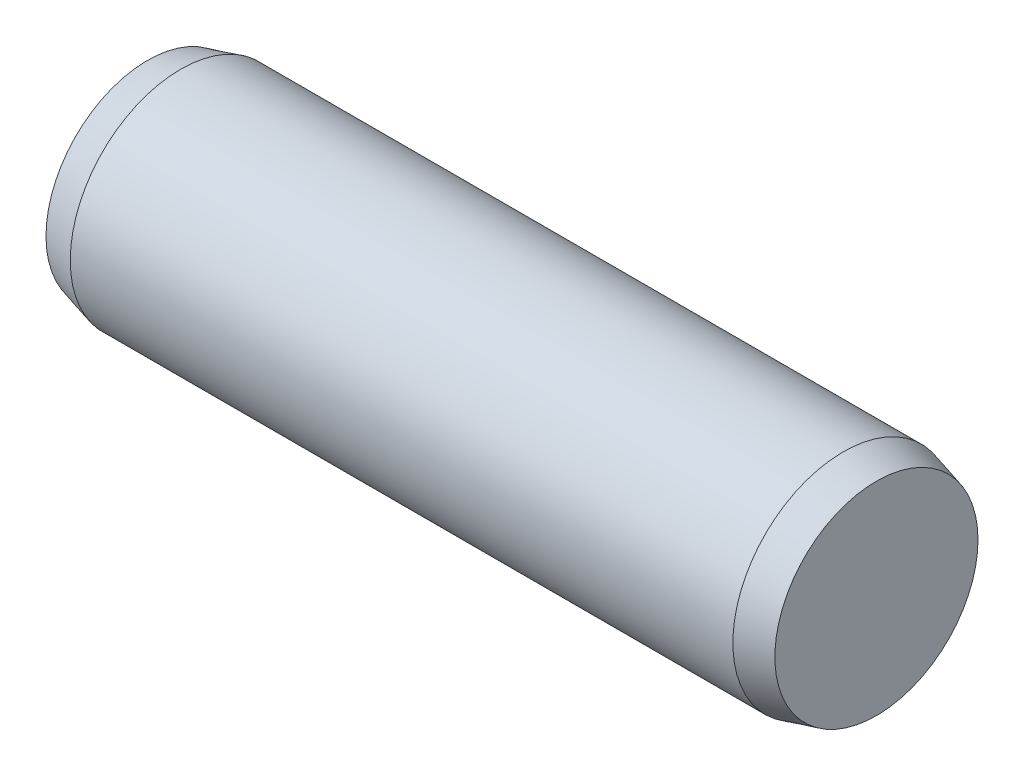
ISO-10303-21;
HEADER;
FILE_DESCRIPTION(('STEP AP214'),'2;1');
FILE_NAME('part.step','',(''),(''),'','','');
FILE_SCHEMA(('AUTOMOTIVE_DESIGN { 1 0 10303 214 1 1 1 1 }'));
ENDSEC;
DATA;
#1=APPLICATION_CONTEXT('core data for automotive mechanical design processes');
#2=APPLICATION_PROTOCOL_DEFINITION('international standard','automotive_design',2000,#1);
#3=PRODUCT_CONTEXT('',#1,'mechanical');
#4=PRODUCT('Part','Part','',(#3));
#5=PRODUCT_RELATED_PRODUCT_CATEGORY('part','',(#4));
#6=PRODUCT_DEFINITION_FORMATION('','',#4);
#7=PRODUCT_DEFINITION_CONTEXT('part definition',#1,'design');
#8=PRODUCT_DEFINITION('design','',#6,#7);
#9=PRODUCT_DEFINITION_SHAPE('','',#8);
#10=(LENGTH_UNIT() NAMED_UNIT(*) SI_UNIT(.MILLI.,.METRE.));
#11=(NAMED_UNIT(*) PLANE_ANGLE_UNIT() SI_UNIT($,.RADIAN.));
#12=(NAMED_UNIT(*) SI_UNIT($,.STERADIAN.) SOLID_ANGLE_UNIT());
#13=UNCERTAINTY_MEASURE_WITH_UNIT(LENGTH_MEASURE(1.E-05),#10,'distance_accuracy_value','');
#14=(GEOMETRIC_REPRESENTATION_CONTEXT(3) GLOBAL_UNCERTAINTY_ASSIGNED_CONTEXT((#13)) GLOBAL_UNIT_ASSIGNED_CONTEXT((#10,
#11,#12)) REPRESENTATION_CONTEXT('',''));
#15=CARTESIAN_POINT('',(0.,0.,0.));
#16=DIRECTION('',(0.,0.,1.));
#17=DIRECTION('',(1.,0.,0.));
#18=AXIS2_PLACEMENT_3D('',#15,#16,#17);
#19=CARTESIAN_POINT('',(-6.,0.,0.));
#20=DIRECTION('',(1.,0.,0.));
#21=DIRECTION('',(0.,0.,-1.));
#22=AXIS2_PLACEMENT_3D('',#19,#20,#21);
#23=CYLINDRICAL_SURFACE('',#22,2.);
#24=CARTESIAN_POINT('',(-6.,0.,0.));
#25=DIRECTION('',(-1.,0.,0.));
#26=DIRECTION('',(0.,0.,1.));
#27=AXIS2_PLACEMENT_3D('',#24,#25,#26);
#28=CIRCLE('',#27,2.);
#29=CARTESIAN_POINT('',(-6.,0.,2.));
#30=VERTEX_POINT('',#29);
#31=EDGE_CURVE('E44',#30,#30,#28,.T.);
#32=ORIENTED_EDGE('',*,*,#31,.F.);
#33=EDGE_LOOP('',(#32));
#34=FACE_BOUND('',#33,.T.);
#35=CARTESIAN_POINT('',(6.,0.,0.));
#36=DIRECTION('',(1.,0.,0.));
#37=DIRECTION('',(0.,0.,-1.));
#38=AXIS2_PLACEMENT_3D('',#35,#36,#37);
#39=CIRCLE('',#38,2.);
#40=CARTESIAN_POINT('',(6.,0.,-2.));
#41=VERTEX_POINT('',#40);
#42=EDGE_CURVE('E10',#41,#41,#39,.T.);
#43=ORIENTED_EDGE('',*,*,#42,.F.);
#44=EDGE_LOOP('',(#43));
#45=FACE_BOUND('',#44,.T.);
#46=ADVANCED_FACE('F30',(#34,#45),#23,.T.);
#47=CARTESIAN_POINT('',(6.,0.,0.));
#48=DIRECTION('',(-1.,0.,0.));
#49=DIRECTION('',(0.,0.,-1.));
#50=AXIS2_PLACEMENT_3D('',#47,#48,#49);
#51=CONICAL_SURFACE('',#50,2.,0.26179938779915);
#52=CARTESIAN_POINT('',(6.6,0.,0.));
#53=DIRECTION('',(1.,0.,0.));
#54=DIRECTION('',(0.,0.,-1.));
#55=AXIS2_PLACEMENT_3D('',#52,#53,#54);
#56=CIRCLE('',#55,1.83923048454133);
#57=CARTESIAN_POINT('',(6.6,0.,-1.83923048454133));
#58=VERTEX_POINT('',#57);
#59=EDGE_CURVE('E36',#58,#58,#56,.T.);
#60=ORIENTED_EDGE('',*,*,#59,.F.);
#61=EDGE_LOOP('',(#60));
#62=FACE_BOUND('',#61,.T.);
#63=ORIENTED_EDGE('',*,*,#42,.T.);
#64=EDGE_LOOP('',(#63));
#65=FACE_BOUND('',#64,.T.);
#66=ADVANCED_FACE('F54',(#62,#65),#51,.T.);
#67=CARTESIAN_POINT('',(6.6,0.,0.));
#68=DIRECTION('',(1.,0.,0.));
#69=DIRECTION('',(0.,0.,-1.));
#70=AXIS2_PLACEMENT_3D('',#67,#68,#69);
#71=PLANE('',#70);
#72=ORIENTED_EDGE('',*,*,#59,.T.);
#73=EDGE_LOOP('',(#72));
#74=FACE_BOUND('',#73,.T.);
#75=ADVANCED_FACE('F58',(#74),#71,.T.);
#76=CARTESIAN_POINT('',(-6.,0.,0.));
#77=DIRECTION('',(1.,0.,0.));
#78=DIRECTION('',(0.,0.,1.));
#79=AXIS2_PLACEMENT_3D('',#76,#77,#78);
#80=CONICAL_SURFACE('',#79,2.,0.26179938779915);
#81=CARTESIAN_POINT('',(-6.6,0.,0.));
#82=DIRECTION('',(-1.,0.,0.));
#83=DIRECTION('',(0.,0.,1.));
#84=AXIS2_PLACEMENT_3D('',#81,#82,#83);
#85=CIRCLE('',#84,1.83923048454133);
#86=CARTESIAN_POINT('',(-6.6,0.,1.83923048454133));
#87=VERTEX_POINT('',#86);
#88=EDGE_CURVE('E40',#87,#87,#85,.T.);
#89=ORIENTED_EDGE('',*,*,#88,.F.);
#90=EDGE_LOOP('',(#89));
#91=FACE_BOUND('',#90,.T.);
#92=ORIENTED_EDGE('',*,*,#31,.T.);
#93=EDGE_LOOP('',(#92));
#94=FACE_BOUND('',#93,.T.);
#95=ADVANCED_FACE('F50',(#91,#94),#80,.T.);
#96=CARTESIAN_POINT('',(-6.6,0.,0.));
#97=DIRECTION('',(-1.,0.,0.));
#98=DIRECTION('',(0.,0.,1.));
#99=AXIS2_PLACEMENT_3D('',#96,#97,#98);
#100=PLANE('',#99);
#101=ORIENTED_EDGE('',*,*,#88,.T.);
#102=EDGE_LOOP('',(#101));
#103=FACE_BOUND('',#102,.T.);
#104=ADVANCED_FACE('F67',(#103),#100,.T.);
#105=CLOSED_SHELL('',(#46,#66,#75,#95,#104));
#106=MANIFOLD_SOLID_BREP('B2',#105);
#107=ADVANCED_BREP_SHAPE_REPRESENTATION('',(#18,#106),#14);
#108=SHAPE_DEFINITION_REPRESENTATION(#9,#107);
ENDSEC;
END-ISO-10303-21;
